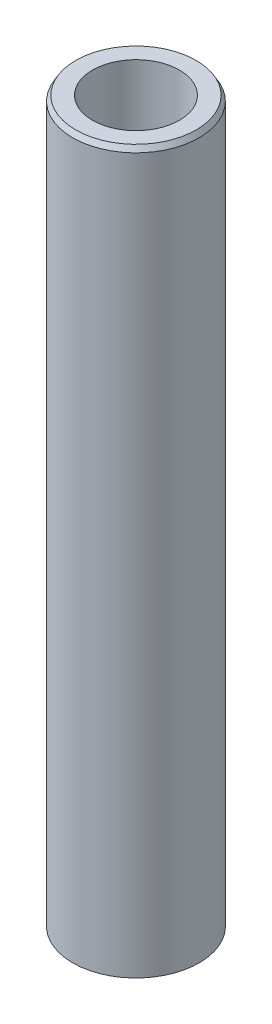
ISO-10303-21;
HEADER;
FILE_DESCRIPTION(('STEP AP214'),'2;1');
FILE_NAME('part.step','',(''),(''),'','','');
FILE_SCHEMA(('AUTOMOTIVE_DESIGN { 1 0 10303 214 1 1 1 1 }'));
ENDSEC;
DATA;
#1=APPLICATION_CONTEXT('core data for automotive mechanical design processes');
#2=APPLICATION_PROTOCOL_DEFINITION('international standard','automotive_design',2000,#1);
#3=PRODUCT_CONTEXT('',#1,'mechanical');
#4=PRODUCT('Part','Part','',(#3));
#5=PRODUCT_RELATED_PRODUCT_CATEGORY('part','',(#4));
#6=PRODUCT_DEFINITION_FORMATION('','',#4);
#7=PRODUCT_DEFINITION_CONTEXT('part definition',#1,'design');
#8=PRODUCT_DEFINITION('design','',#6,#7);
#9=PRODUCT_DEFINITION_SHAPE('','',#8);
#10=(LENGTH_UNIT() NAMED_UNIT(*) SI_UNIT(.MILLI.,.METRE.));
#11=(NAMED_UNIT(*) PLANE_ANGLE_UNIT() SI_UNIT($,.RADIAN.));
#12=(NAMED_UNIT(*) SI_UNIT($,.STERADIAN.) SOLID_ANGLE_UNIT());
#13=UNCERTAINTY_MEASURE_WITH_UNIT(LENGTH_MEASURE(1.E-05),#10,'distance_accuracy_value','');
#14=(GEOMETRIC_REPRESENTATION_CONTEXT(3) GLOBAL_UNCERTAINTY_ASSIGNED_CONTEXT((#13)) GLOBAL_UNIT_ASSIGNED_CONTEXT((#10,
#11,#12)) REPRESENTATION_CONTEXT('',''));
#15=CARTESIAN_POINT('',(0.,0.,0.));
#16=DIRECTION('',(0.,0.,1.));
#17=DIRECTION('',(1.,0.,0.));
#18=AXIS2_PLACEMENT_3D('',#15,#16,#17);
#19=CARTESIAN_POINT('',(0.,600.,0.));
#20=DIRECTION('',(0.,-1.,0.));
#21=DIRECTION('',(0.,0.,-1.));
#22=AXIS2_PLACEMENT_3D('',#19,#20,#21);
#23=CYLINDRICAL_SURFACE('',#22,52.5);
#24=CARTESIAN_POINT('',(0.,595.640247217571,0.));
#25=DIRECTION('',(0.,1.,0.));
#26=DIRECTION('',(0.,0.,1.));
#27=AXIS2_PLACEMENT_3D('',#24,#25,#26);
#28=CIRCLE('',#27,52.5);
#29=CARTESIAN_POINT('',(0.,595.640247217571,52.5));
#30=VERTEX_POINT('',#29);
#31=EDGE_CURVE('E50',#30,#30,#28,.F.);
#32=ORIENTED_EDGE('',*,*,#31,.T.);
#33=EDGE_LOOP('',(#32));
#34=FACE_BOUND('',#33,.T.);
#35=CARTESIAN_POINT('',(0.,2.51710444253583,0.));
#36=DIRECTION('',(0.,1.,0.));
#37=DIRECTION('',(0.,0.,1.));
#38=AXIS2_PLACEMENT_3D('',#35,#36,#37);
#39=CIRCLE('',#38,52.5);
#40=CARTESIAN_POINT('',(0.,2.51710444253583,52.5));
#41=VERTEX_POINT('',#40);
#42=EDGE_CURVE('E51',#41,#41,#39,.T.);
#43=ORIENTED_EDGE('',*,*,#42,.T.);
#44=EDGE_LOOP('',(#43));
#45=FACE_BOUND('',#44,.T.);
#46=ADVANCED_FACE('F39',(#34,#45),#23,.T.);
#47=CARTESIAN_POINT('',(0.,600.,0.));
#48=DIRECTION('',(0.,1.,0.));
#49=DIRECTION('',(0.,0.,1.));
#50=AXIS2_PLACEMENT_3D('',#47,#48,#49);
#51=PLANE('',#50);
#52=CARTESIAN_POINT('',(0.,600.,0.));
#53=DIRECTION('',(0.,1.,0.));
#54=DIRECTION('',(0.,0.,1.));
#55=AXIS2_PLACEMENT_3D('',#52,#53,#54);
#56=CIRCLE('',#55,49.9828955574643);
#57=CARTESIAN_POINT('',(0.,600.,49.9828955574643));
#58=VERTEX_POINT('',#57);
#59=EDGE_CURVE('E54',#58,#58,#56,.T.);
#60=ORIENTED_EDGE('',*,*,#59,.T.);
#61=EDGE_LOOP('',(#60));
#62=FACE_BOUND('',#61,.T.);
#63=CARTESIAN_POINT('',(0.,600.,0.));
#64=DIRECTION('',(0.,1.,0.));
#65=DIRECTION('',(0.,0.,1.));
#66=AXIS2_PLACEMENT_3D('',#63,#64,#65);
#67=CIRCLE('',#66,36.1077091607446);
#68=CARTESIAN_POINT('',(0.,600.,36.1077091607446));
#69=VERTEX_POINT('',#68);
#70=EDGE_CURVE('E58',#69,#69,#67,.T.);
#71=ORIENTED_EDGE('',*,*,#70,.F.);
#72=EDGE_LOOP('',(#71));
#73=FACE_BOUND('',#72,.T.);
#74=ADVANCED_FACE('F69',(#62,#73),#51,.T.);
#75=CARTESIAN_POINT('',(0.,0.,0.));
#76=DIRECTION('',(0.,1.,0.));
#77=DIRECTION('',(0.,0.,1.));
#78=AXIS2_PLACEMENT_3D('',#75,#76,#77);
#79=PLANE('',#78);
#80=CARTESIAN_POINT('',(0.,0.,0.));
#81=DIRECTION('',(0.,1.,0.));
#82=DIRECTION('',(0.,0.,1.));
#83=AXIS2_PLACEMENT_3D('',#80,#81,#82);
#84=CIRCLE('',#83,48.1402472175706);
#85=CARTESIAN_POINT('',(0.,0.,48.1402472175706));
#86=VERTEX_POINT('',#85);
#87=EDGE_CURVE('E10',#86,#86,#84,.F.);
#88=ORIENTED_EDGE('',*,*,#87,.T.);
#89=EDGE_LOOP('',(#88));
#90=FACE_BOUND('',#89,.T.);
#91=CARTESIAN_POINT('',(0.,0.,0.));
#92=DIRECTION('',(0.,1.,0.));
#93=DIRECTION('',(0.,0.,1.));
#94=AXIS2_PLACEMENT_3D('',#91,#92,#93);
#95=CIRCLE('',#94,36.1077091607446);
#96=CARTESIAN_POINT('',(0.,0.,36.1077091607446));
#97=VERTEX_POINT('',#96);
#98=EDGE_CURVE('E63',#97,#97,#95,.T.);
#99=ORIENTED_EDGE('',*,*,#98,.T.);
#100=EDGE_LOOP('',(#99));
#101=FACE_BOUND('',#100,.T.);
#102=ADVANCED_FACE('F75',(#90,#101),#79,.F.);
#103=CARTESIAN_POINT('',(0.,600.,0.));
#104=DIRECTION('',(0.,-1.,0.));
#105=DIRECTION('',(0.,0.,-1.));
#106=AXIS2_PLACEMENT_3D('',#103,#104,#105);
#107=CYLINDRICAL_SURFACE('',#106,36.1077091607446);
#108=ORIENTED_EDGE('',*,*,#70,.T.);
#109=EDGE_LOOP('',(#108));
#110=FACE_BOUND('',#109,.T.);
#111=ORIENTED_EDGE('',*,*,#98,.F.);
#112=EDGE_LOOP('',(#111));
#113=FACE_BOUND('',#112,.T.);
#114=ADVANCED_FACE('F70',(#110,#113),#107,.F.);
#115=CARTESIAN_POINT('',(0.,600.,0.));
#116=DIRECTION('',(0.,-1.,0.));
#117=DIRECTION('',(0.,0.,-1.));
#118=AXIS2_PLACEMENT_3D('',#115,#116,#117);
#119=CONICAL_SURFACE('',#118,49.9828955574643,0.523598775598293);
#120=ORIENTED_EDGE('',*,*,#31,.F.);
#121=EDGE_LOOP('',(#120));
#122=FACE_BOUND('',#121,.T.);
#123=ORIENTED_EDGE('',*,*,#59,.F.);
#124=EDGE_LOOP('',(#123));
#125=FACE_BOUND('',#124,.T.);
#126=ADVANCED_FACE('F81',(#122,#125),#119,.T.);
#127=CARTESIAN_POINT('',(0.,2.51710444253583,0.));
#128=DIRECTION('',(0.,1.,0.));
#129=DIRECTION('',(0.,0.,1.));
#130=AXIS2_PLACEMENT_3D('',#127,#128,#129);
#131=CONICAL_SURFACE('',#130,52.5,1.0471975511966);
#132=ORIENTED_EDGE('',*,*,#87,.F.);
#133=EDGE_LOOP('',(#132));
#134=FACE_BOUND('',#133,.T.);
#135=ORIENTED_EDGE('',*,*,#42,.F.);
#136=EDGE_LOOP('',(#135));
#137=FACE_BOUND('',#136,.T.);
#138=ADVANCED_FACE('F45',(#134,#137),#131,.T.);
#139=CLOSED_SHELL('',(#46,#74,#102,#114,#126,#138));
#140=MANIFOLD_SOLID_BREP('B2',#139);
#141=ADVANCED_BREP_SHAPE_REPRESENTATION('',(#18,#140),#14);
#142=SHAPE_DEFINITION_REPRESENTATION(#9,#141);
ENDSEC;
END-ISO-10303-21;
